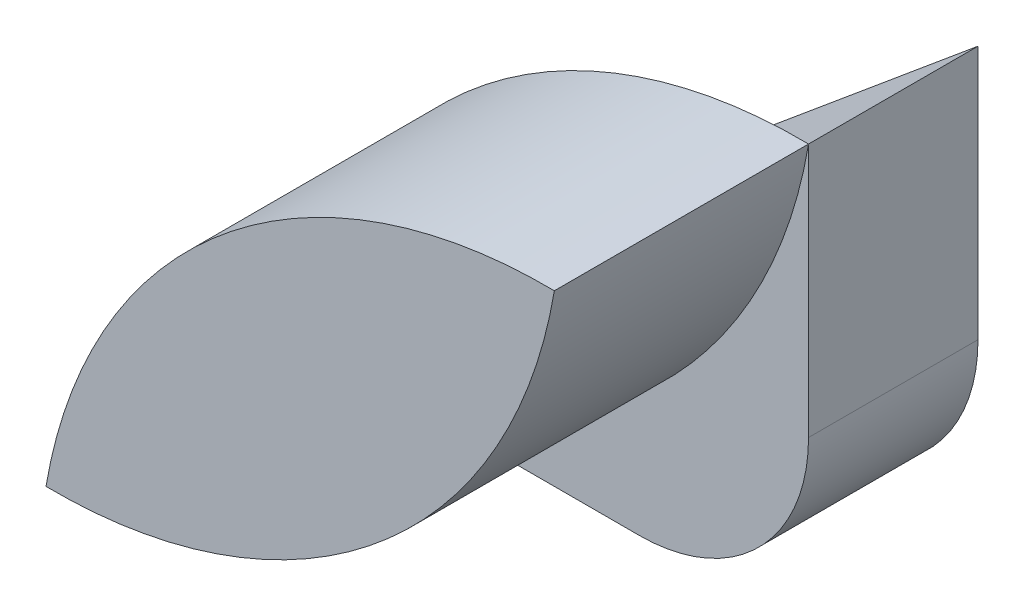
ISO-10303-21;
HEADER;
FILE_DESCRIPTION(('STEP AP214'),'2;1');
FILE_NAME('part.step','',(''),(''),'','','');
FILE_SCHEMA(('AUTOMOTIVE_DESIGN { 1 0 10303 214 1 1 1 1 }'));
ENDSEC;
DATA;
#1=APPLICATION_CONTEXT('core data for automotive mechanical design processes');
#2=APPLICATION_PROTOCOL_DEFINITION('international standard','automotive_design',2000,#1);
#3=PRODUCT_CONTEXT('',#1,'mechanical');
#4=PRODUCT('Part','Part','',(#3));
#5=PRODUCT_RELATED_PRODUCT_CATEGORY('part','',(#4));
#6=PRODUCT_DEFINITION_FORMATION('','',#4);
#7=PRODUCT_DEFINITION_CONTEXT('part definition',#1,'design');
#8=PRODUCT_DEFINITION('design','',#6,#7);
#9=PRODUCT_DEFINITION_SHAPE('','',#8);
#10=(LENGTH_UNIT() NAMED_UNIT(*) SI_UNIT(.MILLI.,.METRE.));
#11=(NAMED_UNIT(*) PLANE_ANGLE_UNIT() SI_UNIT($,.RADIAN.));
#12=(NAMED_UNIT(*) SI_UNIT($,.STERADIAN.) SOLID_ANGLE_UNIT());
#13=UNCERTAINTY_MEASURE_WITH_UNIT(LENGTH_MEASURE(1.E-05),#10,'distance_accuracy_value','');
#14=(GEOMETRIC_REPRESENTATION_CONTEXT(3) GLOBAL_UNCERTAINTY_ASSIGNED_CONTEXT((#13)) GLOBAL_UNIT_ASSIGNED_CONTEXT((#10,
#11,#12)) REPRESENTATION_CONTEXT('',''));
#15=CARTESIAN_POINT('',(0.,0.,0.));
#16=DIRECTION('',(0.,0.,1.));
#17=DIRECTION('',(1.,0.,0.));
#18=AXIS2_PLACEMENT_3D('',#15,#16,#17);
#19=CARTESIAN_POINT('',(-9.99999999999999,-15.,10.));
#20=DIRECTION('',(0.,0.,-1.));
#21=DIRECTION('',(-1.,0.,0.));
#22=AXIS2_PLACEMENT_3D('',#19,#20,#21);
#23=PLANE('',#22);
#24=CARTESIAN_POINT('',(-29.580893628869,4.99707235464283,10.));
#25=DIRECTION('',(0.,0.,1.));
#26=DIRECTION('',(1.,0.,0.));
#27=AXIS2_PLACEMENT_3D('',#24,#25,#26);
#28=CIRCLE('',#27,30.);
#29=CARTESIAN_POINT('',(-29.1617872577379,-25.,10.));
#30=VERTEX_POINT('',#29);
#31=CARTESIAN_POINT('',(0.,0.,10.));
#32=VERTEX_POINT('',#31);
#33=EDGE_CURVE('E11',#30,#32,#28,.T.);
#34=ORIENTED_EDGE('',*,*,#33,.F.);
#35=DIRECTION('',(1.,0.,0.));
#36=VECTOR('',#35,1.);
#37=CARTESIAN_POINT('',(-9.99999999999999,-25.,10.));
#38=LINE('',#37,#36);
#39=CARTESIAN_POINT('',(-9.99999999999999,-25.,10.));
#40=VERTEX_POINT('',#39);
#41=EDGE_CURVE('E78',#30,#40,#38,.T.);
#42=ORIENTED_EDGE('',*,*,#41,.T.);
#43=CARTESIAN_POINT('',(-9.99999999999999,-15.,10.));
#44=DIRECTION('',(0.,0.,1.));
#45=DIRECTION('',(-1.,0.,0.));
#46=AXIS2_PLACEMENT_3D('',#43,#44,#45);
#47=CIRCLE('',#46,10.);
#48=CARTESIAN_POINT('',(0.,-15.,10.));
#49=VERTEX_POINT('',#48);
#50=EDGE_CURVE('E127',#40,#49,#47,.T.);
#51=ORIENTED_EDGE('',*,*,#50,.T.);
#52=DIRECTION('',(0.,1.,0.));
#53=VECTOR('',#52,1.);
#54=CARTESIAN_POINT('',(0.,0.,10.));
#55=LINE('',#54,#53);
#56=EDGE_CURVE('E170',#49,#32,#55,.T.);
#57=ORIENTED_EDGE('',*,*,#56,.T.);
#58=EDGE_LOOP('',(#34,#42,#51,#57));
#59=FACE_BOUND('',#58,.T.);
#60=ADVANCED_FACE('F33',(#59),#23,.F.);
#61=CARTESIAN_POINT('',(-9.99999999999999,-25.,10.));
#62=DIRECTION('',(0.,1.,0.));
#63=DIRECTION('',(-1.,0.,0.));
#64=AXIS2_PLACEMENT_3D('',#61,#62,#63);
#65=PLANE('',#64);
#66=DIRECTION('',(1.,0.,0.));
#67=VECTOR('',#66,1.);
#68=CARTESIAN_POINT('',(-9.99999999999999,-25.,0.));
#69=LINE('',#68,#67);
#70=CARTESIAN_POINT('',(-30.,-25.,0.));
#71=VERTEX_POINT('',#70);
#72=CARTESIAN_POINT('',(-9.99999999999999,-25.,0.));
#73=VERTEX_POINT('',#72);
#74=EDGE_CURVE('E109',#71,#73,#69,.T.);
#75=ORIENTED_EDGE('',*,*,#74,.T.);
#76=DIRECTION('',(0.,0.,-1.));
#77=VECTOR('',#76,1.);
#78=CARTESIAN_POINT('',(-9.99999999999999,-25.,10.));
#79=LINE('',#78,#77);
#80=EDGE_CURVE('E43',#40,#73,#79,.T.);
#81=ORIENTED_EDGE('',*,*,#80,.F.);
#82=ORIENTED_EDGE('',*,*,#41,.F.);
#83=CARTESIAN_POINT('',(-29.580893628869,4.99707235464283,10.));
#84=DIRECTION('',(0.,0.,1.));
#85=DIRECTION('',(-0.0139702123710315,-0.999902411821428,0.));
#86=AXIS2_PLACEMENT_3D('',#83,#84,#85);
#87=CIRCLE('',#86,30.);
#88=CARTESIAN_POINT('',(-30.,-25.,10.));
#89=VERTEX_POINT('',#88);
#90=EDGE_CURVE('E122',#89,#30,#87,.T.);
#91=ORIENTED_EDGE('',*,*,#90,.F.);
#92=DIRECTION('',(0.,0.,-1.));
#93=VECTOR('',#92,1.);
#94=CARTESIAN_POINT('',(-30.,-25.,10.));
#95=LINE('',#94,#93);
#96=EDGE_CURVE('E58',#89,#71,#95,.T.);
#97=ORIENTED_EDGE('',*,*,#96,.T.);
#98=EDGE_LOOP('',(#75,#81,#82,#91,#97));
#99=FACE_BOUND('',#98,.T.);
#100=ADVANCED_FACE('F35',(#99),#65,.F.);
#101=CARTESIAN_POINT('',(-9.99999999999999,-15.,10.));
#102=DIRECTION('',(0.,0.,-1.));
#103=DIRECTION('',(-1.,0.,0.));
#104=AXIS2_PLACEMENT_3D('',#101,#102,#103);
#105=CYLINDRICAL_SURFACE('',#104,10.);
#106=CARTESIAN_POINT('',(-9.99999999999999,-15.,0.));
#107=DIRECTION('',(0.,0.,1.));
#108=DIRECTION('',(-1.,0.,0.));
#109=AXIS2_PLACEMENT_3D('',#106,#107,#108);
#110=CIRCLE('',#109,10.);
#111=CARTESIAN_POINT('',(0.,-15.,0.));
#112=VERTEX_POINT('',#111);
#113=EDGE_CURVE('E112',#73,#112,#110,.T.);
#114=ORIENTED_EDGE('',*,*,#113,.T.);
#115=DIRECTION('',(0.,0.,-1.));
#116=VECTOR('',#115,1.);
#117=CARTESIAN_POINT('',(0.,-15.,10.));
#118=LINE('',#117,#116);
#119=EDGE_CURVE('E162',#49,#112,#118,.T.);
#120=ORIENTED_EDGE('',*,*,#119,.F.);
#121=ORIENTED_EDGE('',*,*,#50,.F.);
#122=ORIENTED_EDGE('',*,*,#80,.T.);
#123=EDGE_LOOP('',(#114,#120,#121,#122));
#124=FACE_BOUND('',#123,.T.);
#125=ADVANCED_FACE('F151',(#124),#105,.T.);
#126=CARTESIAN_POINT('',(0.,0.,10.));
#127=DIRECTION('',(-1.,0.,0.));
#128=DIRECTION('',(0.,-1.,0.));
#129=AXIS2_PLACEMENT_3D('',#126,#127,#128);
#130=PLANE('',#129);
#131=DIRECTION('',(0.,1.,0.));
#132=VECTOR('',#131,1.);
#133=CARTESIAN_POINT('',(0.,0.,0.));
#134=LINE('',#133,#132);
#135=CARTESIAN_POINT('',(0.,0.,0.));
#136=VERTEX_POINT('',#135);
#137=EDGE_CURVE('E167',#112,#136,#134,.T.);
#138=ORIENTED_EDGE('',*,*,#137,.T.);
#139=DIRECTION('',(0.,0.,-1.));
#140=VECTOR('',#139,1.);
#141=CARTESIAN_POINT('',(0.,0.,10.));
#142=LINE('',#141,#140);
#143=EDGE_CURVE('E171',#32,#136,#142,.T.);
#144=ORIENTED_EDGE('',*,*,#143,.F.);
#145=ORIENTED_EDGE('',*,*,#56,.F.);
#146=ORIENTED_EDGE('',*,*,#119,.T.);
#147=EDGE_LOOP('',(#138,#144,#145,#146));
#148=FACE_BOUND('',#147,.T.);
#149=ADVANCED_FACE('F149',(#148),#130,.F.);
#150=CARTESIAN_POINT('',(-30.,-25.,10.));
#151=DIRECTION('',(0.64018439966448,-0.768221279597376,0.));
#152=DIRECTION('',(0.768221279597376,0.64018439966448,0.));
#153=AXIS2_PLACEMENT_3D('',#150,#151,#152);
#154=PLANE('',#153);
#155=DIRECTION('',(-0.768221279597376,-0.64018439966448,0.));
#156=VECTOR('',#155,1.);
#157=CARTESIAN_POINT('',(-30.,-25.,0.));
#158=LINE('',#157,#156);
#159=EDGE_CURVE('E77',#136,#71,#158,.T.);
#160=ORIENTED_EDGE('',*,*,#159,.T.);
#161=ORIENTED_EDGE('',*,*,#96,.F.);
#162=DIRECTION('',(-0.768221279597376,-0.64018439966448,0.));
#163=VECTOR('',#162,1.);
#164=CARTESIAN_POINT('',(-30.,-25.,10.));
#165=LINE('',#164,#163);
#166=EDGE_CURVE('E184',#32,#89,#165,.T.);
#167=ORIENTED_EDGE('',*,*,#166,.F.);
#168=ORIENTED_EDGE('',*,*,#143,.T.);
#169=EDGE_LOOP('',(#160,#161,#167,#168));
#170=FACE_BOUND('',#169,.T.);
#171=ADVANCED_FACE('F145',(#170),#154,.F.);
#172=CARTESIAN_POINT('',(-9.99999999999999,-15.,0.));
#173=DIRECTION('',(0.,0.,-1.));
#174=DIRECTION('',(-1.,0.,0.));
#175=AXIS2_PLACEMENT_3D('',#172,#173,#174);
#176=PLANE('',#175);
#177=ORIENTED_EDGE('',*,*,#74,.F.);
#178=ORIENTED_EDGE('',*,*,#159,.F.);
#179=ORIENTED_EDGE('',*,*,#137,.F.);
#180=ORIENTED_EDGE('',*,*,#113,.F.);
#181=EDGE_LOOP('',(#177,#178,#179,#180));
#182=FACE_BOUND('',#181,.T.);
#183=ADVANCED_FACE('F142',(#182),#176,.T.);
#184=CARTESIAN_POINT('',(-15.,-12.5,10.));
#185=DIRECTION('',(0.,0.,1.));
#186=DIRECTION('',(1.,0.,0.));
#187=AXIS2_PLACEMENT_3D('',#184,#185,#186);
#188=PLANE('',#187);
#189=CARTESIAN_POINT('',(-0.419106371130965,-29.9970723546428,10.));
#190=DIRECTION('',(0.,0.,1.));
#191=DIRECTION('',(-1.,0.,0.));
#192=AXIS2_PLACEMENT_3D('',#189,#190,#191);
#193=CIRCLE('',#192,30.);
#194=EDGE_CURVE('E104',#32,#89,#193,.T.);
#195=ORIENTED_EDGE('',*,*,#194,.F.);
#196=ORIENTED_EDGE('',*,*,#166,.T.);
#197=EDGE_LOOP('',(#195,#196));
#198=FACE_BOUND('',#197,.T.);
#199=ADVANCED_FACE('F138',(#198),#188,.F.);
#200=CARTESIAN_POINT('',(-29.580893628869,4.99707235464283,25.));
#201=DIRECTION('',(0.,0.,-1.));
#202=DIRECTION('',(-1.,0.,0.));
#203=AXIS2_PLACEMENT_3D('',#200,#201,#202);
#204=CYLINDRICAL_SURFACE('',#203,30.);
#205=ORIENTED_EDGE('',*,*,#90,.T.);
#206=ORIENTED_EDGE('',*,*,#33,.T.);
#207=DIRECTION('',(0.,0.,-1.));
#208=VECTOR('',#207,1.);
#209=CARTESIAN_POINT('',(0.,0.,25.));
#210=LINE('',#209,#208);
#211=CARTESIAN_POINT('',(0.,0.,25.));
#212=VERTEX_POINT('',#211);
#213=EDGE_CURVE('E95',#212,#32,#210,.T.);
#214=ORIENTED_EDGE('',*,*,#213,.F.);
#215=CARTESIAN_POINT('',(-29.580893628869,4.99707235464283,25.));
#216=DIRECTION('',(0.,0.,1.));
#217=DIRECTION('',(1.,0.,0.));
#218=AXIS2_PLACEMENT_3D('',#215,#216,#217);
#219=CIRCLE('',#218,30.);
#220=CARTESIAN_POINT('',(-30.,-25.,25.));
#221=VERTEX_POINT('',#220);
#222=EDGE_CURVE('E100',#221,#212,#219,.T.);
#223=ORIENTED_EDGE('',*,*,#222,.F.);
#224=DIRECTION('',(0.,0.,-1.));
#225=VECTOR('',#224,1.);
#226=CARTESIAN_POINT('',(-30.,-25.,25.));
#227=LINE('',#226,#225);
#228=EDGE_CURVE('E97',#221,#89,#227,.T.);
#229=ORIENTED_EDGE('',*,*,#228,.T.);
#230=EDGE_LOOP('',(#205,#206,#214,#223,#229));
#231=FACE_BOUND('',#230,.T.);
#232=ADVANCED_FACE('F107',(#231),#204,.T.);
#233=CARTESIAN_POINT('',(-0.419106371130965,-29.9970723546428,25.));
#234=DIRECTION('',(0.,0.,-1.));
#235=DIRECTION('',(-1.,0.,0.));
#236=AXIS2_PLACEMENT_3D('',#233,#234,#235);
#237=CYLINDRICAL_SURFACE('',#236,30.);
#238=ORIENTED_EDGE('',*,*,#194,.T.);
#239=ORIENTED_EDGE('',*,*,#228,.F.);
#240=CARTESIAN_POINT('',(-0.419106371130965,-29.9970723546428,25.));
#241=DIRECTION('',(0.,0.,1.));
#242=DIRECTION('',(-1.,0.,0.));
#243=AXIS2_PLACEMENT_3D('',#240,#241,#242);
#244=CIRCLE('',#243,30.);
#245=EDGE_CURVE('E90',#212,#221,#244,.T.);
#246=ORIENTED_EDGE('',*,*,#245,.F.);
#247=ORIENTED_EDGE('',*,*,#213,.T.);
#248=EDGE_LOOP('',(#238,#239,#246,#247));
#249=FACE_BOUND('',#248,.T.);
#250=ADVANCED_FACE('F93',(#249),#237,.T.);
#251=CARTESIAN_POINT('',(-15.,-12.5,25.));
#252=DIRECTION('',(0.,0.,1.));
#253=DIRECTION('',(1.,0.,0.));
#254=AXIS2_PLACEMENT_3D('',#251,#252,#253);
#255=PLANE('',#254);
#256=ORIENTED_EDGE('',*,*,#222,.T.);
#257=ORIENTED_EDGE('',*,*,#245,.T.);
#258=EDGE_LOOP('',(#256,#257));
#259=FACE_BOUND('',#258,.T.);
#260=ADVANCED_FACE('F102',(#259),#255,.T.);
#261=CLOSED_SHELL('',(#60,#100,#125,#149,#171,#183,#199,#232,#250,#260));
#262=MANIFOLD_SOLID_BREP('B2',#261);
#263=ADVANCED_BREP_SHAPE_REPRESENTATION('',(#18,#262),#14);
#264=SHAPE_DEFINITION_REPRESENTATION(#9,#263);
ENDSEC;
END-ISO-10303-21;
